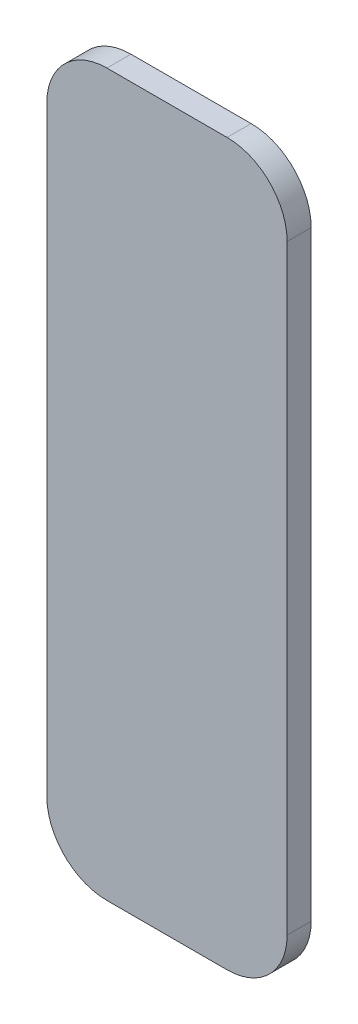
ISO-10303-21;
HEADER;
FILE_DESCRIPTION(('STEP AP214'),'2;1');
FILE_NAME('part.step','',(''),(''),'','','');
FILE_SCHEMA(('AUTOMOTIVE_DESIGN { 1 0 10303 214 1 1 1 1 }'));
ENDSEC;
DATA;
#1=APPLICATION_CONTEXT('core data for automotive mechanical design processes');
#2=APPLICATION_PROTOCOL_DEFINITION('international standard','automotive_design',2000,#1);
#3=PRODUCT_CONTEXT('',#1,'mechanical');
#4=PRODUCT('Part','Part','',(#3));
#5=PRODUCT_RELATED_PRODUCT_CATEGORY('part','',(#4));
#6=PRODUCT_DEFINITION_FORMATION('','',#4);
#7=PRODUCT_DEFINITION_CONTEXT('part definition',#1,'design');
#8=PRODUCT_DEFINITION('design','',#6,#7);
#9=PRODUCT_DEFINITION_SHAPE('','',#8);
#10=(LENGTH_UNIT() NAMED_UNIT(*) SI_UNIT(.MILLI.,.METRE.));
#11=(NAMED_UNIT(*) PLANE_ANGLE_UNIT() SI_UNIT($,.RADIAN.));
#12=(NAMED_UNIT(*) SI_UNIT($,.STERADIAN.) SOLID_ANGLE_UNIT());
#13=UNCERTAINTY_MEASURE_WITH_UNIT(LENGTH_MEASURE(1.E-05),#10,'distance_accuracy_value','');
#14=(GEOMETRIC_REPRESENTATION_CONTEXT(3) GLOBAL_UNCERTAINTY_ASSIGNED_CONTEXT((#13)) GLOBAL_UNIT_ASSIGNED_CONTEXT((#10,
#11,#12)) REPRESENTATION_CONTEXT('',''));
#15=CARTESIAN_POINT('',(0.,0.,0.));
#16=DIRECTION('',(0.,0.,1.));
#17=DIRECTION('',(1.,0.,0.));
#18=AXIS2_PLACEMENT_3D('',#15,#16,#17);
#19=CARTESIAN_POINT('',(-6.35,6.35,2.54));
#20=DIRECTION('',(0.,0.,-1.));
#21=DIRECTION('',(-1.,0.,0.));
#22=AXIS2_PLACEMENT_3D('',#19,#20,#21);
#23=CYLINDRICAL_SURFACE('',#22,6.35);
#24=CARTESIAN_POINT('',(-6.35,6.35,0.));
#25=DIRECTION('',(0.,0.,1.));
#26=DIRECTION('',(1.,0.,0.));
#27=AXIS2_PLACEMENT_3D('',#24,#25,#26);
#28=CIRCLE('',#27,6.35);
#29=CARTESIAN_POINT('',(-6.35000000000004,0.,0.));
#30=VERTEX_POINT('',#29);
#31=CARTESIAN_POINT('',(0.,6.35000000000004,0.));
#32=VERTEX_POINT('',#31);
#33=EDGE_CURVE('E150',#30,#32,#28,.T.);
#34=ORIENTED_EDGE('',*,*,#33,.T.);
#35=DIRECTION('',(0.,0.,-1.));
#36=VECTOR('',#35,1.);
#37=CARTESIAN_POINT('',(0.,6.35000000000004,2.54));
#38=LINE('',#37,#36);
#39=CARTESIAN_POINT('',(0.,6.35000000000004,2.54));
#40=VERTEX_POINT('',#39);
#41=EDGE_CURVE('E11',#40,#32,#38,.T.);
#42=ORIENTED_EDGE('',*,*,#41,.F.);
#43=CARTESIAN_POINT('',(-6.35,6.35,2.54));
#44=DIRECTION('',(0.,0.,1.));
#45=DIRECTION('',(1.,0.,0.));
#46=AXIS2_PLACEMENT_3D('',#43,#44,#45);
#47=CIRCLE('',#46,6.35);
#48=CARTESIAN_POINT('',(-6.35000000000004,0.,2.54));
#49=VERTEX_POINT('',#48);
#50=EDGE_CURVE('E172',#49,#40,#47,.T.);
#51=ORIENTED_EDGE('',*,*,#50,.F.);
#52=DIRECTION('',(0.,0.,-1.));
#53=VECTOR('',#52,1.);
#54=CARTESIAN_POINT('',(-6.35000000000004,0.,2.54));
#55=LINE('',#54,#53);
#56=EDGE_CURVE('E146',#49,#30,#55,.T.);
#57=ORIENTED_EDGE('',*,*,#56,.T.);
#58=EDGE_LOOP('',(#34,#42,#51,#57));
#59=FACE_BOUND('',#58,.T.);
#60=ADVANCED_FACE('F49',(#59),#23,.T.);
#61=CARTESIAN_POINT('',(0.,6.35000000000004,2.54));
#62=DIRECTION('',(-1.,0.,0.));
#63=DIRECTION('',(0.,0.,1.));
#64=AXIS2_PLACEMENT_3D('',#61,#62,#63);
#65=PLANE('',#64);
#66=DIRECTION('',(0.,1.,0.));
#67=VECTOR('',#66,1.);
#68=CARTESIAN_POINT('',(0.,6.35000000000004,0.));
#69=LINE('',#68,#67);
#70=CARTESIAN_POINT('',(0.,69.85,0.));
#71=VERTEX_POINT('',#70);
#72=EDGE_CURVE('E154',#32,#71,#69,.T.);
#73=ORIENTED_EDGE('',*,*,#72,.T.);
#74=DIRECTION('',(0.,0.,-1.));
#75=VECTOR('',#74,1.);
#76=CARTESIAN_POINT('',(0.,69.85,2.54));
#77=LINE('',#76,#75);
#78=CARTESIAN_POINT('',(0.,69.85,2.54));
#79=VERTEX_POINT('',#78);
#80=EDGE_CURVE('E58',#79,#71,#77,.T.);
#81=ORIENTED_EDGE('',*,*,#80,.F.);
#82=DIRECTION('',(0.,1.,0.));
#83=VECTOR('',#82,1.);
#84=CARTESIAN_POINT('',(0.,6.35000000000004,2.54));
#85=LINE('',#84,#83);
#86=EDGE_CURVE('E109',#40,#79,#85,.T.);
#87=ORIENTED_EDGE('',*,*,#86,.F.);
#88=ORIENTED_EDGE('',*,*,#41,.T.);
#89=EDGE_LOOP('',(#73,#81,#87,#88));
#90=FACE_BOUND('',#89,.T.);
#91=ADVANCED_FACE('F218',(#90),#65,.F.);
#92=CARTESIAN_POINT('',(-6.35,69.85,2.54));
#93=DIRECTION('',(0.,0.,-1.));
#94=DIRECTION('',(-1.,0.,0.));
#95=AXIS2_PLACEMENT_3D('',#92,#93,#94);
#96=CYLINDRICAL_SURFACE('',#95,6.35);
#97=CARTESIAN_POINT('',(-6.35,69.85,0.));
#98=DIRECTION('',(0.,0.,1.));
#99=DIRECTION('',(1.,0.,0.));
#100=AXIS2_PLACEMENT_3D('',#97,#98,#99);
#101=CIRCLE('',#100,6.35);
#102=CARTESIAN_POINT('',(-6.35000000000004,76.2,0.));
#103=VERTEX_POINT('',#102);
#104=EDGE_CURVE('E157',#71,#103,#101,.T.);
#105=ORIENTED_EDGE('',*,*,#104,.T.);
#106=DIRECTION('',(0.,0.,-1.));
#107=VECTOR('',#106,1.);
#108=CARTESIAN_POINT('',(-6.35000000000004,76.2,2.54));
#109=LINE('',#108,#107);
#110=CARTESIAN_POINT('',(-6.35000000000004,76.2,2.54));
#111=VERTEX_POINT('',#110);
#112=EDGE_CURVE('E183',#111,#103,#109,.T.);
#113=ORIENTED_EDGE('',*,*,#112,.F.);
#114=CARTESIAN_POINT('',(-6.35,69.85,2.54));
#115=DIRECTION('',(0.,0.,1.));
#116=DIRECTION('',(1.,0.,0.));
#117=AXIS2_PLACEMENT_3D('',#114,#115,#116);
#118=CIRCLE('',#117,6.35);
#119=EDGE_CURVE('E193',#79,#111,#118,.T.);
#120=ORIENTED_EDGE('',*,*,#119,.F.);
#121=ORIENTED_EDGE('',*,*,#80,.T.);
#122=EDGE_LOOP('',(#105,#113,#120,#121));
#123=FACE_BOUND('',#122,.T.);
#124=ADVANCED_FACE('F191',(#123),#96,.T.);
#125=CARTESIAN_POINT('',(-6.35000000000004,76.2,2.54));
#126=DIRECTION('',(0.,-1.,0.));
#127=DIRECTION('',(0.,0.,-1.));
#128=AXIS2_PLACEMENT_3D('',#125,#126,#127);
#129=PLANE('',#128);
#130=DIRECTION('',(-1.,0.,0.));
#131=VECTOR('',#130,1.);
#132=CARTESIAN_POINT('',(-6.35000000000004,76.2,0.));
#133=LINE('',#132,#131);
#134=CARTESIAN_POINT('',(-19.05,76.2,0.));
#135=VERTEX_POINT('',#134);
#136=EDGE_CURVE('E160',#103,#135,#133,.T.);
#137=ORIENTED_EDGE('',*,*,#136,.T.);
#138=DIRECTION('',(0.,0.,-1.));
#139=VECTOR('',#138,1.);
#140=CARTESIAN_POINT('',(-19.05,76.2,2.54));
#141=LINE('',#140,#139);
#142=CARTESIAN_POINT('',(-19.05,76.2,2.54));
#143=VERTEX_POINT('',#142);
#144=EDGE_CURVE('E179',#143,#135,#141,.T.);
#145=ORIENTED_EDGE('',*,*,#144,.F.);
#146=DIRECTION('',(-1.,0.,0.));
#147=VECTOR('',#146,1.);
#148=CARTESIAN_POINT('',(-6.35000000000004,76.2,2.54));
#149=LINE('',#148,#147);
#150=EDGE_CURVE('E206',#111,#143,#149,.T.);
#151=ORIENTED_EDGE('',*,*,#150,.F.);
#152=ORIENTED_EDGE('',*,*,#112,.T.);
#153=EDGE_LOOP('',(#137,#145,#151,#152));
#154=FACE_BOUND('',#153,.T.);
#155=ADVANCED_FACE('F201',(#154),#129,.F.);
#156=CARTESIAN_POINT('',(-19.05,69.85,2.54));
#157=DIRECTION('',(0.,0.,-1.));
#158=DIRECTION('',(-1.,0.,0.));
#159=AXIS2_PLACEMENT_3D('',#156,#157,#158);
#160=CYLINDRICAL_SURFACE('',#159,6.35);
#161=CARTESIAN_POINT('',(-19.05,69.85,0.));
#162=DIRECTION('',(0.,0.,1.));
#163=DIRECTION('',(1.,0.,0.));
#164=AXIS2_PLACEMENT_3D('',#161,#162,#163);
#165=CIRCLE('',#164,6.35);
#166=CARTESIAN_POINT('',(-25.4,69.85,0.));
#167=VERTEX_POINT('',#166);
#168=EDGE_CURVE('E163',#135,#167,#165,.T.);
#169=ORIENTED_EDGE('',*,*,#168,.T.);
#170=DIRECTION('',(0.,0.,-1.));
#171=VECTOR('',#170,1.);
#172=CARTESIAN_POINT('',(-25.4,69.85,2.54));
#173=LINE('',#172,#171);
#174=CARTESIAN_POINT('',(-25.4,69.85,2.54));
#175=VERTEX_POINT('',#174);
#176=EDGE_CURVE('E139',#175,#167,#173,.T.);
#177=ORIENTED_EDGE('',*,*,#176,.F.);
#178=CARTESIAN_POINT('',(-19.05,69.85,2.54));
#179=DIRECTION('',(0.,0.,1.));
#180=DIRECTION('',(1.,0.,0.));
#181=AXIS2_PLACEMENT_3D('',#178,#179,#180);
#182=CIRCLE('',#181,6.35);
#183=EDGE_CURVE('E128',#143,#175,#182,.T.);
#184=ORIENTED_EDGE('',*,*,#183,.F.);
#185=ORIENTED_EDGE('',*,*,#144,.T.);
#186=EDGE_LOOP('',(#169,#177,#184,#185));
#187=FACE_BOUND('',#186,.T.);
#188=ADVANCED_FACE('F204',(#187),#160,.T.);
#189=CARTESIAN_POINT('',(-25.4,6.35000000000004,2.54));
#190=DIRECTION('',(1.,0.,0.));
#191=DIRECTION('',(0.,0.,-1.));
#192=AXIS2_PLACEMENT_3D('',#189,#190,#191);
#193=PLANE('',#192);
#194=DIRECTION('',(0.,-1.,0.));
#195=VECTOR('',#194,1.);
#196=CARTESIAN_POINT('',(-25.4,6.35000000000004,0.));
#197=LINE('',#196,#195);
#198=CARTESIAN_POINT('',(-25.4,6.35000000000004,0.));
#199=VERTEX_POINT('',#198);
#200=EDGE_CURVE('E137',#167,#199,#197,.T.);
#201=ORIENTED_EDGE('',*,*,#200,.T.);
#202=DIRECTION('',(0.,0.,-1.));
#203=VECTOR('',#202,1.);
#204=CARTESIAN_POINT('',(-25.4,6.35000000000004,2.54));
#205=LINE('',#204,#203);
#206=CARTESIAN_POINT('',(-25.4,6.35000000000004,2.54));
#207=VERTEX_POINT('',#206);
#208=EDGE_CURVE('E134',#207,#199,#205,.T.);
#209=ORIENTED_EDGE('',*,*,#208,.F.);
#210=DIRECTION('',(0.,-1.,0.));
#211=VECTOR('',#210,1.);
#212=CARTESIAN_POINT('',(-25.4,6.35000000000004,2.54));
#213=LINE('',#212,#211);
#214=EDGE_CURVE('E122',#175,#207,#213,.T.);
#215=ORIENTED_EDGE('',*,*,#214,.F.);
#216=ORIENTED_EDGE('',*,*,#176,.T.);
#217=EDGE_LOOP('',(#201,#209,#215,#216));
#218=FACE_BOUND('',#217,.T.);
#219=ADVANCED_FACE('F135',(#218),#193,.F.);
#220=CARTESIAN_POINT('',(-19.05,6.35,2.54));
#221=DIRECTION('',(0.,0.,-1.));
#222=DIRECTION('',(-1.,0.,0.));
#223=AXIS2_PLACEMENT_3D('',#220,#221,#222);
#224=CYLINDRICAL_SURFACE('',#223,6.35);
#225=CARTESIAN_POINT('',(-19.05,6.35,0.));
#226=DIRECTION('',(0.,0.,1.));
#227=DIRECTION('',(1.,0.,0.));
#228=AXIS2_PLACEMENT_3D('',#225,#226,#227);
#229=CIRCLE('',#228,6.35);
#230=CARTESIAN_POINT('',(-19.05,0.,0.));
#231=VERTEX_POINT('',#230);
#232=EDGE_CURVE('E95',#199,#231,#229,.T.);
#233=ORIENTED_EDGE('',*,*,#232,.T.);
#234=DIRECTION('',(0.,0.,-1.));
#235=VECTOR('',#234,1.);
#236=CARTESIAN_POINT('',(-19.05,0.,2.54));
#237=LINE('',#236,#235);
#238=CARTESIAN_POINT('',(-19.05,0.,2.54));
#239=VERTEX_POINT('',#238);
#240=EDGE_CURVE('E140',#239,#231,#237,.T.);
#241=ORIENTED_EDGE('',*,*,#240,.F.);
#242=CARTESIAN_POINT('',(-19.05,6.35,2.54));
#243=DIRECTION('',(0.,0.,1.));
#244=DIRECTION('',(1.,0.,0.));
#245=AXIS2_PLACEMENT_3D('',#242,#243,#244);
#246=CIRCLE('',#245,6.35);
#247=EDGE_CURVE('E126',#207,#239,#246,.T.);
#248=ORIENTED_EDGE('',*,*,#247,.F.);
#249=ORIENTED_EDGE('',*,*,#208,.T.);
#250=EDGE_LOOP('',(#233,#241,#248,#249));
#251=FACE_BOUND('',#250,.T.);
#252=ADVANCED_FACE('F142',(#251),#224,.T.);
#253=CARTESIAN_POINT('',(-6.35000000000004,0.,2.54));
#254=DIRECTION('',(0.,1.,0.));
#255=DIRECTION('',(0.,0.,1.));
#256=AXIS2_PLACEMENT_3D('',#253,#254,#255);
#257=PLANE('',#256);
#258=DIRECTION('',(1.,0.,0.));
#259=VECTOR('',#258,1.);
#260=CARTESIAN_POINT('',(-6.35000000000004,0.,0.));
#261=LINE('',#260,#259);
#262=EDGE_CURVE('E101',#231,#30,#261,.T.);
#263=ORIENTED_EDGE('',*,*,#262,.T.);
#264=ORIENTED_EDGE('',*,*,#56,.F.);
#265=DIRECTION('',(1.,0.,0.));
#266=VECTOR('',#265,1.);
#267=CARTESIAN_POINT('',(-6.35000000000004,0.,2.54));
#268=LINE('',#267,#266);
#269=EDGE_CURVE('E66',#239,#49,#268,.T.);
#270=ORIENTED_EDGE('',*,*,#269,.F.);
#271=ORIENTED_EDGE('',*,*,#240,.T.);
#272=EDGE_LOOP('',(#263,#264,#270,#271));
#273=FACE_BOUND('',#272,.T.);
#274=ADVANCED_FACE('F234',(#273),#257,.F.);
#275=CARTESIAN_POINT('',(-6.35,6.35,2.54));
#276=DIRECTION('',(0.,0.,1.));
#277=DIRECTION('',(1.,0.,0.));
#278=AXIS2_PLACEMENT_3D('',#275,#276,#277);
#279=PLANE('',#278);
#280=ORIENTED_EDGE('',*,*,#50,.T.);
#281=ORIENTED_EDGE('',*,*,#86,.T.);
#282=ORIENTED_EDGE('',*,*,#119,.T.);
#283=ORIENTED_EDGE('',*,*,#150,.T.);
#284=ORIENTED_EDGE('',*,*,#183,.T.);
#285=ORIENTED_EDGE('',*,*,#214,.T.);
#286=ORIENTED_EDGE('',*,*,#247,.T.);
#287=ORIENTED_EDGE('',*,*,#269,.T.);
#288=EDGE_LOOP('',(#280,#281,#282,#283,#284,#285,#286,#287));
#289=FACE_BOUND('',#288,.T.);
#290=ADVANCED_FACE('F124',(#289),#279,.T.);
#291=CARTESIAN_POINT('',(-6.35,6.35,0.));
#292=DIRECTION('',(0.,0.,1.));
#293=DIRECTION('',(1.,0.,0.));
#294=AXIS2_PLACEMENT_3D('',#291,#292,#293);
#295=PLANE('',#294);
#296=ORIENTED_EDGE('',*,*,#33,.F.);
#297=ORIENTED_EDGE('',*,*,#262,.F.);
#298=ORIENTED_EDGE('',*,*,#232,.F.);
#299=ORIENTED_EDGE('',*,*,#200,.F.);
#300=ORIENTED_EDGE('',*,*,#168,.F.);
#301=ORIENTED_EDGE('',*,*,#136,.F.);
#302=ORIENTED_EDGE('',*,*,#104,.F.);
#303=ORIENTED_EDGE('',*,*,#72,.F.);
#304=EDGE_LOOP('',(#296,#297,#298,#299,#300,#301,#302,#303));
#305=FACE_BOUND('',#304,.T.);
#306=ADVANCED_FACE('F197',(#305),#295,.F.);
#307=CLOSED_SHELL('',(#60,#91,#124,#155,#188,#219,#252,#274,#290,#306));
#308=MANIFOLD_SOLID_BREP('B2',#307);
#309=ADVANCED_BREP_SHAPE_REPRESENTATION('',(#18,#308),#14);
#310=SHAPE_DEFINITION_REPRESENTATION(#9,#309);
ENDSEC;
END-ISO-10303-21;
